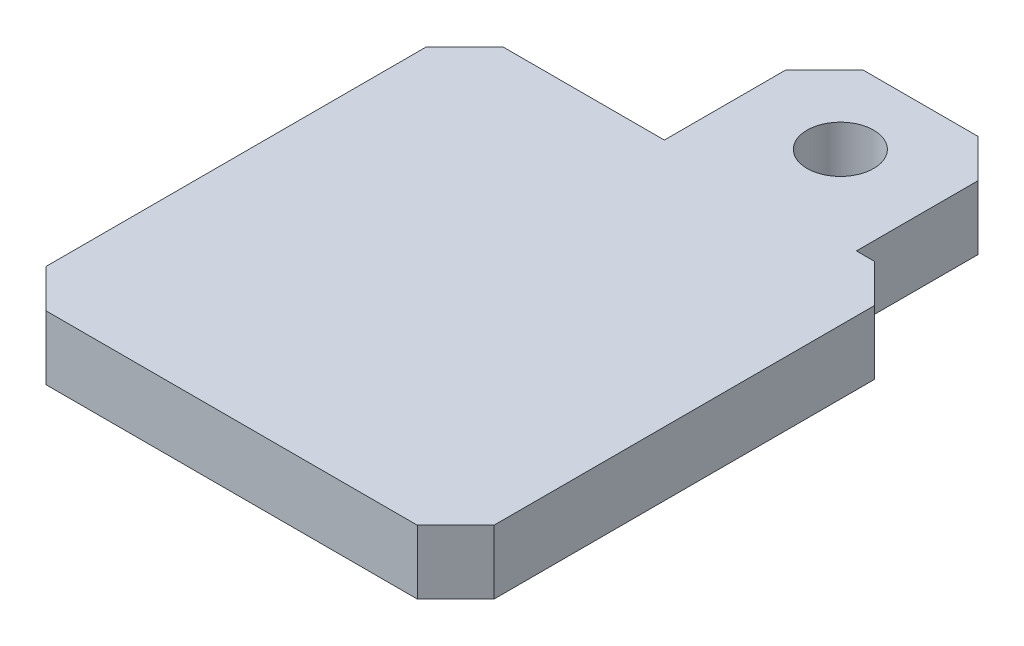
ISO-10303-21;
HEADER;
FILE_DESCRIPTION(('STEP AP214'),'2;1');
FILE_NAME('part.step','',(''),(''),'','','');
FILE_SCHEMA(('AUTOMOTIVE_DESIGN { 1 0 10303 214 1 1 1 1 }'));
ENDSEC;
DATA;
#1=APPLICATION_CONTEXT('core data for automotive mechanical design processes');
#2=APPLICATION_PROTOCOL_DEFINITION('international standard','automotive_design',2000,#1);
#3=PRODUCT_CONTEXT('',#1,'mechanical');
#4=PRODUCT('Part','Part','',(#3));
#5=PRODUCT_RELATED_PRODUCT_CATEGORY('part','',(#4));
#6=PRODUCT_DEFINITION_FORMATION('','',#4);
#7=PRODUCT_DEFINITION_CONTEXT('part definition',#1,'design');
#8=PRODUCT_DEFINITION('design','',#6,#7);
#9=PRODUCT_DEFINITION_SHAPE('','',#8);
#10=(LENGTH_UNIT() NAMED_UNIT(*) SI_UNIT(.MILLI.,.METRE.));
#11=(NAMED_UNIT(*) PLANE_ANGLE_UNIT() SI_UNIT($,.RADIAN.));
#12=(NAMED_UNIT(*) SI_UNIT($,.STERADIAN.) SOLID_ANGLE_UNIT());
#13=UNCERTAINTY_MEASURE_WITH_UNIT(LENGTH_MEASURE(1.E-05),#10,'distance_accuracy_value','');
#14=(GEOMETRIC_REPRESENTATION_CONTEXT(3) GLOBAL_UNCERTAINTY_ASSIGNED_CONTEXT((#13)) GLOBAL_UNIT_ASSIGNED_CONTEXT((#10,
#11,#12)) REPRESENTATION_CONTEXT('',''));
#15=CARTESIAN_POINT('',(0.,0.,0.));
#16=DIRECTION('',(0.,0.,1.));
#17=DIRECTION('',(1.,0.,0.));
#18=AXIS2_PLACEMENT_3D('',#15,#16,#17);
#19=CARTESIAN_POINT('',(5.6,5.,-23.75));
#20=DIRECTION('',(0.,-1.,0.));
#21=DIRECTION('',(0.,0.,-1.));
#22=AXIS2_PLACEMENT_3D('',#19,#20,#21);
#23=CYLINDRICAL_SURFACE('',#22,2.6);
#24=CARTESIAN_POINT('',(5.6,0.,-23.75));
#25=DIRECTION('',(0.,1.,0.));
#26=DIRECTION('',(0.,0.,1.));
#27=AXIS2_PLACEMENT_3D('',#24,#25,#26);
#28=CIRCLE('',#27,2.6);
#29=CARTESIAN_POINT('',(5.6,0.,-21.15));
#30=VERTEX_POINT('',#29);
#31=EDGE_CURVE('E200',#30,#30,#28,.T.);
#32=ORIENTED_EDGE('',*,*,#31,.F.);
#33=EDGE_LOOP('',(#32));
#34=FACE_BOUND('',#33,.T.);
#35=CARTESIAN_POINT('',(5.6,0.3,-23.75));
#36=DIRECTION('',(0.,1.,0.));
#37=DIRECTION('',(0.,0.,1.));
#38=AXIS2_PLACEMENT_3D('',#35,#36,#37);
#39=CIRCLE('',#38,2.6);
#40=CARTESIAN_POINT('',(5.6,0.3,-21.15));
#41=VERTEX_POINT('',#40);
#42=EDGE_CURVE('E203',#41,#41,#39,.T.);
#43=ORIENTED_EDGE('',*,*,#42,.T.);
#44=EDGE_LOOP('',(#43));
#45=FACE_BOUND('',#44,.T.);
#46=ADVANCED_FACE('F49',(#34,#45),#23,.F.);
#47=CARTESIAN_POINT('',(-1.9,5.,0.));
#48=DIRECTION('',(-1.,0.,0.));
#49=DIRECTION('',(0.,0.,1.));
#50=AXIS2_PLACEMENT_3D('',#47,#48,#49);
#51=PLANE('',#50);
#52=DIRECTION('',(0.,0.,-1.));
#53=VECTOR('',#52,1.);
#54=CARTESIAN_POINT('',(-1.9,5.,0.));
#55=LINE('',#54,#53);
#56=CARTESIAN_POINT('',(-1.9,5.,-17.5));
#57=VERTEX_POINT('',#56);
#58=CARTESIAN_POINT('',(-1.9,5.,-27.));
#59=VERTEX_POINT('',#58);
#60=EDGE_CURVE('E164',#57,#59,#55,.T.);
#61=ORIENTED_EDGE('',*,*,#60,.T.);
#62=DIRECTION('',(0.,-1.,0.));
#63=VECTOR('',#62,1.);
#64=CARTESIAN_POINT('',(-1.9,0.,-27.));
#65=LINE('',#64,#63);
#66=CARTESIAN_POINT('',(-1.9,0.,-27.));
#67=VERTEX_POINT('',#66);
#68=EDGE_CURVE('E250',#59,#67,#65,.T.);
#69=ORIENTED_EDGE('',*,*,#68,.T.);
#70=DIRECTION('',(0.,0.,-1.));
#71=VECTOR('',#70,1.);
#72=CARTESIAN_POINT('',(-1.9,0.,0.));
#73=LINE('',#72,#71);
#74=CARTESIAN_POINT('',(-1.9,0.,-17.5));
#75=VERTEX_POINT('',#74);
#76=EDGE_CURVE('E173',#75,#67,#73,.T.);
#77=ORIENTED_EDGE('',*,*,#76,.F.);
#78=DIRECTION('',(0.,-1.,0.));
#79=VECTOR('',#78,1.);
#80=CARTESIAN_POINT('',(-1.9,5.,-17.5));
#81=LINE('',#80,#79);
#82=EDGE_CURVE('E158',#57,#75,#81,.T.);
#83=ORIENTED_EDGE('',*,*,#82,.F.);
#84=EDGE_LOOP('',(#61,#69,#77,#83));
#85=FACE_BOUND('',#84,.T.);
#86=ADVANCED_FACE('F169',(#85),#51,.T.);
#87=CARTESIAN_POINT('',(0.,5.,-17.5));
#88=DIRECTION('',(0.,0.,-1.));
#89=DIRECTION('',(-1.,0.,0.));
#90=AXIS2_PLACEMENT_3D('',#87,#88,#89);
#91=PLANE('',#90);
#92=DIRECTION('',(1.,0.,0.));
#93=VECTOR('',#92,1.);
#94=CARTESIAN_POINT('',(0.,0.,-17.5));
#95=LINE('',#94,#93);
#96=CARTESIAN_POINT('',(-14.5,0.,-17.5));
#97=VERTEX_POINT('',#96);
#98=EDGE_CURVE('E205',#97,#75,#95,.T.);
#99=ORIENTED_EDGE('',*,*,#98,.F.);
#100=DIRECTION('',(0.,1.,0.));
#101=VECTOR('',#100,1.);
#102=CARTESIAN_POINT('',(-14.5,5.,-17.5));
#103=LINE('',#102,#101);
#104=CARTESIAN_POINT('',(-14.5,5.,-17.5));
#105=VERTEX_POINT('',#104);
#106=EDGE_CURVE('E58',#97,#105,#103,.T.);
#107=ORIENTED_EDGE('',*,*,#106,.T.);
#108=DIRECTION('',(1.,0.,0.));
#109=VECTOR('',#108,1.);
#110=CARTESIAN_POINT('',(0.,5.,-17.5));
#111=LINE('',#110,#109);
#112=EDGE_CURVE('E154',#105,#57,#111,.T.);
#113=ORIENTED_EDGE('',*,*,#112,.T.);
#114=ORIENTED_EDGE('',*,*,#82,.T.);
#115=EDGE_LOOP('',(#99,#107,#113,#114));
#116=FACE_BOUND('',#115,.T.);
#117=ADVANCED_FACE('F157',(#116),#91,.T.);
#118=CARTESIAN_POINT('',(-17.5,5.,0.));
#119=DIRECTION('',(-1.,0.,0.));
#120=DIRECTION('',(0.,0.,1.));
#121=AXIS2_PLACEMENT_3D('',#118,#119,#120);
#122=PLANE('',#121);
#123=DIRECTION('',(0.,0.,-1.));
#124=VECTOR('',#123,1.);
#125=CARTESIAN_POINT('',(-17.5,0.,0.));
#126=LINE('',#125,#124);
#127=CARTESIAN_POINT('',(-17.5,0.,15.2));
#128=VERTEX_POINT('',#127);
#129=CARTESIAN_POINT('',(-17.5,0.,-14.5));
#130=VERTEX_POINT('',#129);
#131=EDGE_CURVE('E207',#128,#130,#126,.T.);
#132=ORIENTED_EDGE('',*,*,#131,.F.);
#133=DIRECTION('',(0.,1.,0.));
#134=VECTOR('',#133,1.);
#135=CARTESIAN_POINT('',(-17.5,5.,15.2));
#136=LINE('',#135,#134);
#137=CARTESIAN_POINT('',(-17.5,5.,15.2));
#138=VERTEX_POINT('',#137);
#139=EDGE_CURVE('E267',#128,#138,#136,.T.);
#140=ORIENTED_EDGE('',*,*,#139,.T.);
#141=DIRECTION('',(0.,0.,-1.));
#142=VECTOR('',#141,1.);
#143=CARTESIAN_POINT('',(-17.5,5.,0.));
#144=LINE('',#143,#142);
#145=CARTESIAN_POINT('',(-17.5,5.,-14.5));
#146=VERTEX_POINT('',#145);
#147=EDGE_CURVE('E163',#138,#146,#144,.T.);
#148=ORIENTED_EDGE('',*,*,#147,.T.);
#149=DIRECTION('',(0.,-1.,0.));
#150=VECTOR('',#149,1.);
#151=CARTESIAN_POINT('',(-17.5,5.,-14.5));
#152=LINE('',#151,#150);
#153=EDGE_CURVE('E264',#146,#130,#152,.T.);
#154=ORIENTED_EDGE('',*,*,#153,.T.);
#155=EDGE_LOOP('',(#132,#140,#148,#154));
#156=FACE_BOUND('',#155,.T.);
#157=ADVANCED_FACE('F272',(#156),#122,.T.);
#158=CARTESIAN_POINT('',(0.,5.,18.2));
#159=DIRECTION('',(0.,0.,-1.));
#160=DIRECTION('',(-1.,0.,0.));
#161=AXIS2_PLACEMENT_3D('',#158,#159,#160);
#162=PLANE('',#161);
#163=DIRECTION('',(1.,0.,0.));
#164=VECTOR('',#163,1.);
#165=CARTESIAN_POINT('',(0.,0.,18.2));
#166=LINE('',#165,#164);
#167=CARTESIAN_POINT('',(-14.5,0.,18.2));
#168=VERTEX_POINT('',#167);
#169=CARTESIAN_POINT('',(14.5,0.,18.2));
#170=VERTEX_POINT('',#169);
#171=EDGE_CURVE('E211',#168,#170,#166,.T.);
#172=ORIENTED_EDGE('',*,*,#171,.T.);
#173=DIRECTION('',(0.,1.,0.));
#174=VECTOR('',#173,1.);
#175=CARTESIAN_POINT('',(14.5,5.,18.2));
#176=LINE('',#175,#174);
#177=CARTESIAN_POINT('',(14.5,5.,18.2));
#178=VERTEX_POINT('',#177);
#179=EDGE_CURVE('E259',#170,#178,#176,.T.);
#180=ORIENTED_EDGE('',*,*,#179,.T.);
#181=DIRECTION('',(1.,0.,0.));
#182=VECTOR('',#181,1.);
#183=CARTESIAN_POINT('',(0.,5.,18.2));
#184=LINE('',#183,#182);
#185=CARTESIAN_POINT('',(-14.5,5.,18.2));
#186=VERTEX_POINT('',#185);
#187=EDGE_CURVE('E191',#186,#178,#184,.T.);
#188=ORIENTED_EDGE('',*,*,#187,.F.);
#189=DIRECTION('',(0.,-1.,0.));
#190=VECTOR('',#189,1.);
#191=CARTESIAN_POINT('',(-14.5,0.,18.2));
#192=LINE('',#191,#190);
#193=EDGE_CURVE('E256',#186,#168,#192,.T.);
#194=ORIENTED_EDGE('',*,*,#193,.T.);
#195=EDGE_LOOP('',(#172,#180,#188,#194));
#196=FACE_BOUND('',#195,.T.);
#197=ADVANCED_FACE('F281',(#196),#162,.F.);
#198=CARTESIAN_POINT('',(17.5,5.,0.));
#199=DIRECTION('',(-1.,0.,0.));
#200=DIRECTION('',(0.,0.,1.));
#201=AXIS2_PLACEMENT_3D('',#198,#199,#200);
#202=PLANE('',#201);
#203=DIRECTION('',(0.,0.,-1.));
#204=VECTOR('',#203,1.);
#205=CARTESIAN_POINT('',(17.5,5.,0.));
#206=LINE('',#205,#204);
#207=CARTESIAN_POINT('',(17.5,5.,15.2));
#208=VERTEX_POINT('',#207);
#209=CARTESIAN_POINT('',(17.5,5.,-14.5));
#210=VERTEX_POINT('',#209);
#211=EDGE_CURVE('E194',#208,#210,#206,.T.);
#212=ORIENTED_EDGE('',*,*,#211,.F.);
#213=DIRECTION('',(0.,-1.,0.));
#214=VECTOR('',#213,1.);
#215=CARTESIAN_POINT('',(17.5,5.,15.2));
#216=LINE('',#215,#214);
#217=CARTESIAN_POINT('',(17.5,0.,15.2));
#218=VERTEX_POINT('',#217);
#219=EDGE_CURVE('E253',#208,#218,#216,.T.);
#220=ORIENTED_EDGE('',*,*,#219,.T.);
#221=DIRECTION('',(0.,0.,-1.));
#222=VECTOR('',#221,1.);
#223=CARTESIAN_POINT('',(17.5,0.,0.));
#224=LINE('',#223,#222);
#225=CARTESIAN_POINT('',(17.5,0.,-14.5));
#226=VERTEX_POINT('',#225);
#227=EDGE_CURVE('E214',#218,#226,#224,.T.);
#228=ORIENTED_EDGE('',*,*,#227,.T.);
#229=DIRECTION('',(0.,1.,0.));
#230=VECTOR('',#229,1.);
#231=CARTESIAN_POINT('',(17.5,5.,-14.5));
#232=LINE('',#231,#230);
#233=EDGE_CURVE('E73',#226,#210,#232,.T.);
#234=ORIENTED_EDGE('',*,*,#233,.T.);
#235=EDGE_LOOP('',(#212,#220,#228,#234));
#236=FACE_BOUND('',#235,.T.);
#237=ADVANCED_FACE('F291',(#236),#202,.F.);
#238=CARTESIAN_POINT('',(13.1,5.,-17.5));
#239=VERTEX_POINT('',#238);
#240=CARTESIAN_POINT('',(14.5,5.,-17.5));
#241=VERTEX_POINT('',#240);
#242=EDGE_CURVE('E166',#239,#241,#111,.T.);
#243=ORIENTED_EDGE('',*,*,#242,.T.);
#244=DIRECTION('',(0.,-1.,0.));
#245=VECTOR('',#244,1.);
#246=CARTESIAN_POINT('',(14.5,0.,-17.5));
#247=LINE('',#246,#245);
#248=CARTESIAN_POINT('',(14.5,0.,-17.5));
#249=VERTEX_POINT('',#248);
#250=EDGE_CURVE('E261',#241,#249,#247,.T.);
#251=ORIENTED_EDGE('',*,*,#250,.T.);
#252=CARTESIAN_POINT('',(13.1,0.,-17.5));
#253=VERTEX_POINT('',#252);
#254=EDGE_CURVE('E208',#253,#249,#95,.T.);
#255=ORIENTED_EDGE('',*,*,#254,.F.);
#256=DIRECTION('',(0.,-1.,0.));
#257=VECTOR('',#256,1.);
#258=CARTESIAN_POINT('',(13.1,5.,-17.5));
#259=LINE('',#258,#257);
#260=EDGE_CURVE('E175',#239,#253,#259,.T.);
#261=ORIENTED_EDGE('',*,*,#260,.F.);
#262=EDGE_LOOP('',(#243,#251,#255,#261));
#263=FACE_BOUND('',#262,.T.);
#264=ADVANCED_FACE('F298',(#263),#91,.T.);
#265=CARTESIAN_POINT('',(13.1,5.,0.));
#266=DIRECTION('',(-1.,0.,0.));
#267=DIRECTION('',(0.,0.,1.));
#268=AXIS2_PLACEMENT_3D('',#265,#266,#267);
#269=PLANE('',#268);
#270=DIRECTION('',(0.,0.,-1.));
#271=VECTOR('',#270,1.);
#272=CARTESIAN_POINT('',(13.1,0.,0.));
#273=LINE('',#272,#271);
#274=CARTESIAN_POINT('',(13.1,0.,-27.));
#275=VERTEX_POINT('',#274);
#276=EDGE_CURVE('E216',#253,#275,#273,.T.);
#277=ORIENTED_EDGE('',*,*,#276,.T.);
#278=DIRECTION('',(0.,1.,0.));
#279=VECTOR('',#278,1.);
#280=CARTESIAN_POINT('',(13.1,5.,-27.));
#281=LINE('',#280,#279);
#282=CARTESIAN_POINT('',(13.1,5.,-27.));
#283=VERTEX_POINT('',#282);
#284=EDGE_CURVE('E238',#275,#283,#281,.T.);
#285=ORIENTED_EDGE('',*,*,#284,.T.);
#286=DIRECTION('',(0.,0.,-1.));
#287=VECTOR('',#286,1.);
#288=CARTESIAN_POINT('',(13.1,5.,0.));
#289=LINE('',#288,#287);
#290=EDGE_CURVE('E196',#239,#283,#289,.T.);
#291=ORIENTED_EDGE('',*,*,#290,.F.);
#292=ORIENTED_EDGE('',*,*,#260,.T.);
#293=EDGE_LOOP('',(#277,#285,#291,#292));
#294=FACE_BOUND('',#293,.T.);
#295=ADVANCED_FACE('F302',(#294),#269,.F.);
#296=CARTESIAN_POINT('',(5.6,1.3,-23.75));
#297=DIRECTION('',(0.,1.,0.));
#298=DIRECTION('',(0.,0.,1.));
#299=AXIS2_PLACEMENT_3D('',#296,#297,#298);
#300=CIRCLE('',#299,2.6);
#301=CARTESIAN_POINT('',(5.6,1.3,-21.15));
#302=VERTEX_POINT('',#301);
#303=EDGE_CURVE('E11',#302,#302,#300,.T.);
#304=ORIENTED_EDGE('',*,*,#303,.F.);
#305=EDGE_LOOP('',(#304));
#306=FACE_BOUND('',#305,.T.);
#307=CARTESIAN_POINT('',(5.6,5.,-23.75));
#308=DIRECTION('',(0.,1.,0.));
#309=DIRECTION('',(0.,0.,1.));
#310=AXIS2_PLACEMENT_3D('',#307,#308,#309);
#311=CIRCLE('',#310,2.6);
#312=CARTESIAN_POINT('',(5.6,5.,-21.15));
#313=VERTEX_POINT('',#312);
#314=EDGE_CURVE('E182',#313,#313,#311,.T.);
#315=ORIENTED_EDGE('',*,*,#314,.T.);
#316=EDGE_LOOP('',(#315));
#317=FACE_BOUND('',#316,.T.);
#318=ADVANCED_FACE('F327',(#306,#317),#23,.F.);
#319=CARTESIAN_POINT('',(0.,5.,-30.));
#320=DIRECTION('',(0.,0.,1.));
#321=DIRECTION('',(1.,0.,0.));
#322=AXIS2_PLACEMENT_3D('',#319,#320,#321);
#323=PLANE('',#322);
#324=DIRECTION('',(-1.,0.,0.));
#325=VECTOR('',#324,1.);
#326=CARTESIAN_POINT('',(0.,5.,-30.));
#327=LINE('',#326,#325);
#328=CARTESIAN_POINT('',(10.1,5.,-30.));
#329=VERTEX_POINT('',#328);
#330=CARTESIAN_POINT('',(1.09999999999997,5.,-30.));
#331=VERTEX_POINT('',#330);
#332=EDGE_CURVE('E198',#329,#331,#327,.T.);
#333=ORIENTED_EDGE('',*,*,#332,.F.);
#334=DIRECTION('',(0.,-1.,0.));
#335=VECTOR('',#334,1.);
#336=CARTESIAN_POINT('',(10.1,5.,-30.));
#337=LINE('',#336,#335);
#338=CARTESIAN_POINT('',(10.1,0.,-30.));
#339=VERTEX_POINT('',#338);
#340=EDGE_CURVE('E223',#329,#339,#337,.T.);
#341=ORIENTED_EDGE('',*,*,#340,.T.);
#342=DIRECTION('',(-1.,0.,0.));
#343=VECTOR('',#342,1.);
#344=CARTESIAN_POINT('',(0.,0.,-30.));
#345=LINE('',#344,#343);
#346=CARTESIAN_POINT('',(1.09999999999997,0.,-30.));
#347=VERTEX_POINT('',#346);
#348=EDGE_CURVE('E185',#339,#347,#345,.T.);
#349=ORIENTED_EDGE('',*,*,#348,.T.);
#350=DIRECTION('',(0.,1.,0.));
#351=VECTOR('',#350,1.);
#352=CARTESIAN_POINT('',(1.09999999999997,5.,-30.));
#353=LINE('',#352,#351);
#354=EDGE_CURVE('E174',#347,#331,#353,.T.);
#355=ORIENTED_EDGE('',*,*,#354,.T.);
#356=EDGE_LOOP('',(#333,#341,#349,#355));
#357=FACE_BOUND('',#356,.T.);
#358=ADVANCED_FACE('F310',(#357),#323,.F.);
#359=CARTESIAN_POINT('',(0.,5.,0.));
#360=DIRECTION('',(0.,1.,0.));
#361=DIRECTION('',(0.,0.,1.));
#362=AXIS2_PLACEMENT_3D('',#359,#360,#361);
#363=PLANE('',#362);
#364=ORIENTED_EDGE('',*,*,#314,.F.);
#365=EDGE_LOOP('',(#364));
#366=FACE_BOUND('',#365,.T.);
#367=ORIENTED_EDGE('',*,*,#290,.T.);
#368=DIRECTION('',(0.707106781186546,0.,0.707106781186549));
#369=VECTOR('',#368,1.);
#370=CARTESIAN_POINT('',(20.05,5.,-20.05));
#371=LINE('',#370,#369);
#372=EDGE_CURVE('E248',#283,#329,#371,.F.);
#373=ORIENTED_EDGE('',*,*,#372,.T.);
#374=ORIENTED_EDGE('',*,*,#332,.T.);
#375=DIRECTION('',(-0.707106781186547,0.,0.707106781186548));
#376=VECTOR('',#375,1.);
#377=CARTESIAN_POINT('',(-14.45,5.,-14.45));
#378=LINE('',#377,#376);
#379=EDGE_CURVE('E181',#331,#59,#378,.T.);
#380=ORIENTED_EDGE('',*,*,#379,.T.);
#381=ORIENTED_EDGE('',*,*,#60,.F.);
#382=ORIENTED_EDGE('',*,*,#112,.F.);
#383=DIRECTION('',(0.707106781186548,0.,-0.707106781186547));
#384=VECTOR('',#383,1.);
#385=CARTESIAN_POINT('',(-16.,5.,-16.));
#386=LINE('',#385,#384);
#387=EDGE_CURVE('E240',#105,#146,#386,.F.);
#388=ORIENTED_EDGE('',*,*,#387,.T.);
#389=ORIENTED_EDGE('',*,*,#147,.F.);
#390=DIRECTION('',(0.707106781186547,0.,0.707106781186548));
#391=VECTOR('',#390,1.);
#392=CARTESIAN_POINT('',(-16.35,5.,16.35));
#393=LINE('',#392,#391);
#394=EDGE_CURVE('E242',#138,#186,#393,.T.);
#395=ORIENTED_EDGE('',*,*,#394,.T.);
#396=ORIENTED_EDGE('',*,*,#187,.T.);
#397=DIRECTION('',(-0.707106781186548,0.,0.707106781186547));
#398=VECTOR('',#397,1.);
#399=CARTESIAN_POINT('',(16.35,5.,16.35));
#400=LINE('',#399,#398);
#401=EDGE_CURVE('E245',#178,#208,#400,.F.);
#402=ORIENTED_EDGE('',*,*,#401,.T.);
#403=ORIENTED_EDGE('',*,*,#211,.T.);
#404=DIRECTION('',(-0.707106781186547,0.,-0.707106781186548));
#405=VECTOR('',#404,1.);
#406=CARTESIAN_POINT('',(16.,5.,-16.));
#407=LINE('',#406,#405);
#408=EDGE_CURVE('E65',#210,#241,#407,.T.);
#409=ORIENTED_EDGE('',*,*,#408,.T.);
#410=ORIENTED_EDGE('',*,*,#242,.F.);
#411=EDGE_LOOP('',(#367,#373,#374,#380,#381,#382,#388,#389,#395,#396,#402,#403,#409,#410));
#412=FACE_BOUND('',#411,.T.);
#413=ADVANCED_FACE('F178',(#366,#412),#363,.T.);
#414=CARTESIAN_POINT('',(0.,0.,0.));
#415=DIRECTION('',(0.,1.,0.));
#416=DIRECTION('',(0.,0.,1.));
#417=AXIS2_PLACEMENT_3D('',#414,#415,#416);
#418=PLANE('',#417);
#419=ORIENTED_EDGE('',*,*,#31,.T.);
#420=EDGE_LOOP('',(#419));
#421=FACE_BOUND('',#420,.T.);
#422=ORIENTED_EDGE('',*,*,#348,.F.);
#423=DIRECTION('',(-0.707106781186546,0.,-0.707106781186549));
#424=VECTOR('',#423,1.);
#425=CARTESIAN_POINT('',(10.1,0.,-30.));
#426=LINE('',#425,#424);
#427=EDGE_CURVE('E236',#339,#275,#426,.F.);
#428=ORIENTED_EDGE('',*,*,#427,.T.);
#429=ORIENTED_EDGE('',*,*,#276,.F.);
#430=ORIENTED_EDGE('',*,*,#254,.T.);
#431=DIRECTION('',(0.707106781186547,0.,0.707106781186548));
#432=VECTOR('',#431,1.);
#433=CARTESIAN_POINT('',(14.5,0.,-17.5));
#434=LINE('',#433,#432);
#435=EDGE_CURVE('E230',#249,#226,#434,.T.);
#436=ORIENTED_EDGE('',*,*,#435,.T.);
#437=ORIENTED_EDGE('',*,*,#227,.F.);
#438=DIRECTION('',(0.707106781186548,0.,-0.707106781186547));
#439=VECTOR('',#438,1.);
#440=CARTESIAN_POINT('',(17.5,0.,15.2));
#441=LINE('',#440,#439);
#442=EDGE_CURVE('E232',#218,#170,#441,.F.);
#443=ORIENTED_EDGE('',*,*,#442,.T.);
#444=ORIENTED_EDGE('',*,*,#171,.F.);
#445=DIRECTION('',(-0.707106781186547,0.,-0.707106781186548));
#446=VECTOR('',#445,1.);
#447=CARTESIAN_POINT('',(-14.5,0.,18.2));
#448=LINE('',#447,#446);
#449=EDGE_CURVE('E228',#168,#128,#448,.T.);
#450=ORIENTED_EDGE('',*,*,#449,.T.);
#451=ORIENTED_EDGE('',*,*,#131,.T.);
#452=DIRECTION('',(-0.707106781186548,0.,0.707106781186547));
#453=VECTOR('',#452,1.);
#454=CARTESIAN_POINT('',(-17.5,0.,-14.5));
#455=LINE('',#454,#453);
#456=EDGE_CURVE('E226',#130,#97,#455,.F.);
#457=ORIENTED_EDGE('',*,*,#456,.T.);
#458=ORIENTED_EDGE('',*,*,#98,.T.);
#459=ORIENTED_EDGE('',*,*,#76,.T.);
#460=DIRECTION('',(0.707106781186547,0.,-0.707106781186548));
#461=VECTOR('',#460,1.);
#462=CARTESIAN_POINT('',(-1.9,0.,-27.));
#463=LINE('',#462,#461);
#464=EDGE_CURVE('E234',#67,#347,#463,.T.);
#465=ORIENTED_EDGE('',*,*,#464,.T.);
#466=EDGE_LOOP('',(#422,#428,#429,#430,#436,#437,#443,#444,#450,#451,#457,#458,#459,#465));
#467=FACE_BOUND('',#466,.T.);
#468=ADVANCED_FACE('F285',(#421,#467),#418,.F.);
#469=CARTESIAN_POINT('',(10.1,5.,-30.));
#470=DIRECTION('',(-0.707106781186549,0.,0.707106781186546));
#471=DIRECTION('',(0.,-1.,0.));
#472=AXIS2_PLACEMENT_3D('',#469,#470,#471);
#473=PLANE('',#472);
#474=ORIENTED_EDGE('',*,*,#372,.F.);
#475=ORIENTED_EDGE('',*,*,#284,.F.);
#476=ORIENTED_EDGE('',*,*,#427,.F.);
#477=ORIENTED_EDGE('',*,*,#340,.F.);
#478=EDGE_LOOP('',(#474,#475,#476,#477));
#479=FACE_BOUND('',#478,.T.);
#480=ADVANCED_FACE('F306',(#479),#473,.F.);
#481=CARTESIAN_POINT('',(-1.9,5.,-27.));
#482=DIRECTION('',(-0.707106781186548,0.,-0.707106781186547));
#483=DIRECTION('',(0.,1.,0.));
#484=AXIS2_PLACEMENT_3D('',#481,#482,#483);
#485=PLANE('',#484);
#486=ORIENTED_EDGE('',*,*,#379,.F.);
#487=ORIENTED_EDGE('',*,*,#354,.F.);
#488=ORIENTED_EDGE('',*,*,#464,.F.);
#489=ORIENTED_EDGE('',*,*,#68,.F.);
#490=EDGE_LOOP('',(#486,#487,#488,#489));
#491=FACE_BOUND('',#490,.T.);
#492=ADVANCED_FACE('F313',(#491),#485,.T.);
#493=CARTESIAN_POINT('',(17.5,5.,15.2));
#494=DIRECTION('',(-0.707106781186547,0.,-0.707106781186548));
#495=DIRECTION('',(0.,-1.,0.));
#496=AXIS2_PLACEMENT_3D('',#493,#494,#495);
#497=PLANE('',#496);
#498=ORIENTED_EDGE('',*,*,#401,.F.);
#499=ORIENTED_EDGE('',*,*,#179,.F.);
#500=ORIENTED_EDGE('',*,*,#442,.F.);
#501=ORIENTED_EDGE('',*,*,#219,.F.);
#502=EDGE_LOOP('',(#498,#499,#500,#501));
#503=FACE_BOUND('',#502,.T.);
#504=ADVANCED_FACE('F290',(#503),#497,.F.);
#505=CARTESIAN_POINT('',(14.5,5.,-17.5));
#506=DIRECTION('',(0.707106781186548,0.,-0.707106781186547));
#507=DIRECTION('',(0.,1.,0.));
#508=AXIS2_PLACEMENT_3D('',#505,#506,#507);
#509=PLANE('',#508);
#510=ORIENTED_EDGE('',*,*,#408,.F.);
#511=ORIENTED_EDGE('',*,*,#233,.F.);
#512=ORIENTED_EDGE('',*,*,#435,.F.);
#513=ORIENTED_EDGE('',*,*,#250,.F.);
#514=EDGE_LOOP('',(#510,#511,#512,#513));
#515=FACE_BOUND('',#514,.T.);
#516=ADVANCED_FACE('F294',(#515),#509,.T.);
#517=CARTESIAN_POINT('',(-14.5,5.,18.2));
#518=DIRECTION('',(-0.707106781186548,0.,0.707106781186547));
#519=DIRECTION('',(0.,1.,0.));
#520=AXIS2_PLACEMENT_3D('',#517,#518,#519);
#521=PLANE('',#520);
#522=ORIENTED_EDGE('',*,*,#394,.F.);
#523=ORIENTED_EDGE('',*,*,#139,.F.);
#524=ORIENTED_EDGE('',*,*,#449,.F.);
#525=ORIENTED_EDGE('',*,*,#193,.F.);
#526=EDGE_LOOP('',(#522,#523,#524,#525));
#527=FACE_BOUND('',#526,.T.);
#528=ADVANCED_FACE('F278',(#527),#521,.T.);
#529=CARTESIAN_POINT('',(-17.5,5.,-14.5));
#530=DIRECTION('',(0.707106781186547,0.,0.707106781186548));
#531=DIRECTION('',(0.,-1.,0.));
#532=AXIS2_PLACEMENT_3D('',#529,#530,#531);
#533=PLANE('',#532);
#534=ORIENTED_EDGE('',*,*,#387,.F.);
#535=ORIENTED_EDGE('',*,*,#106,.F.);
#536=ORIENTED_EDGE('',*,*,#456,.F.);
#537=ORIENTED_EDGE('',*,*,#153,.F.);
#538=EDGE_LOOP('',(#534,#535,#536,#537));
#539=FACE_BOUND('',#538,.T.);
#540=ADVANCED_FACE('F52',(#539),#533,.F.);
#541=CARTESIAN_POINT('',(5.6,1.3,-23.75));
#542=DIRECTION('',(0.,1.,0.));
#543=DIRECTION('',(0.,0.,1.));
#544=AXIS2_PLACEMENT_3D('',#541,#542,#543);
#545=PLANE('',#544);
#546=ORIENTED_EDGE('',*,*,#303,.T.);
#547=EDGE_LOOP('',(#546));
#548=FACE_BOUND('',#547,.T.);
#549=CARTESIAN_POINT('',(5.6,1.3,-23.75));
#550=DIRECTION('',(0.,1.,0.));
#551=DIRECTION('',(0.,0.,1.));
#552=AXIS2_PLACEMENT_3D('',#549,#550,#551);
#553=CIRCLE('',#552,1.58);
#554=CARTESIAN_POINT('',(5.6,1.3,-22.17));
#555=VERTEX_POINT('',#554);
#556=EDGE_CURVE('E494',#555,#555,#553,.T.);
#557=ORIENTED_EDGE('',*,*,#556,.F.);
#558=EDGE_LOOP('',(#557));
#559=FACE_BOUND('',#558,.T.);
#560=ADVANCED_FACE('F316',(#548,#559),#545,.T.);
#561=CARTESIAN_POINT('',(5.6,0.3,-23.75));
#562=DIRECTION('',(0.,1.,0.));
#563=DIRECTION('',(0.,0.,1.));
#564=AXIS2_PLACEMENT_3D('',#561,#562,#563);
#565=PLANE('',#564);
#566=ORIENTED_EDGE('',*,*,#42,.F.);
#567=EDGE_LOOP('',(#566));
#568=FACE_BOUND('',#567,.T.);
#569=CARTESIAN_POINT('',(5.6,0.3,-23.75));
#570=DIRECTION('',(0.,1.,0.));
#571=DIRECTION('',(0.,0.,1.));
#572=AXIS2_PLACEMENT_3D('',#569,#570,#571);
#573=CIRCLE('',#572,1.58);
#574=CARTESIAN_POINT('',(5.6,0.3,-22.17));
#575=VERTEX_POINT('',#574);
#576=EDGE_CURVE('E497',#575,#575,#573,.T.);
#577=ORIENTED_EDGE('',*,*,#576,.T.);
#578=EDGE_LOOP('',(#577));
#579=FACE_BOUND('',#578,.T.);
#580=ADVANCED_FACE('F322',(#568,#579),#565,.F.);
#581=CARTESIAN_POINT('',(5.6,1.3,-23.75));
#582=DIRECTION('',(0.,-1.,0.));
#583=DIRECTION('',(0.,0.,-1.));
#584=AXIS2_PLACEMENT_3D('',#581,#582,#583);
#585=CYLINDRICAL_SURFACE('',#584,1.58);
#586=ORIENTED_EDGE('',*,*,#556,.T.);
#587=EDGE_LOOP('',(#586));
#588=FACE_BOUND('',#587,.T.);
#589=ORIENTED_EDGE('',*,*,#576,.F.);
#590=EDGE_LOOP('',(#589));
#591=FACE_BOUND('',#590,.T.);
#592=ADVANCED_FACE('F477',(#588,#591),#585,.F.);
#593=CLOSED_SHELL('',(#46,#86,#117,#157,#197,#237,#264,#295,#318,#358,#413,#468,#480,#492,#504,
#516,#528,#540,#560,#580,#592));
#594=MANIFOLD_SOLID_BREP('B2',#593);
#595=ADVANCED_BREP_SHAPE_REPRESENTATION('',(#18,#594),#14);
#596=SHAPE_DEFINITION_REPRESENTATION(#9,#595);
ENDSEC;
END-ISO-10303-21;
